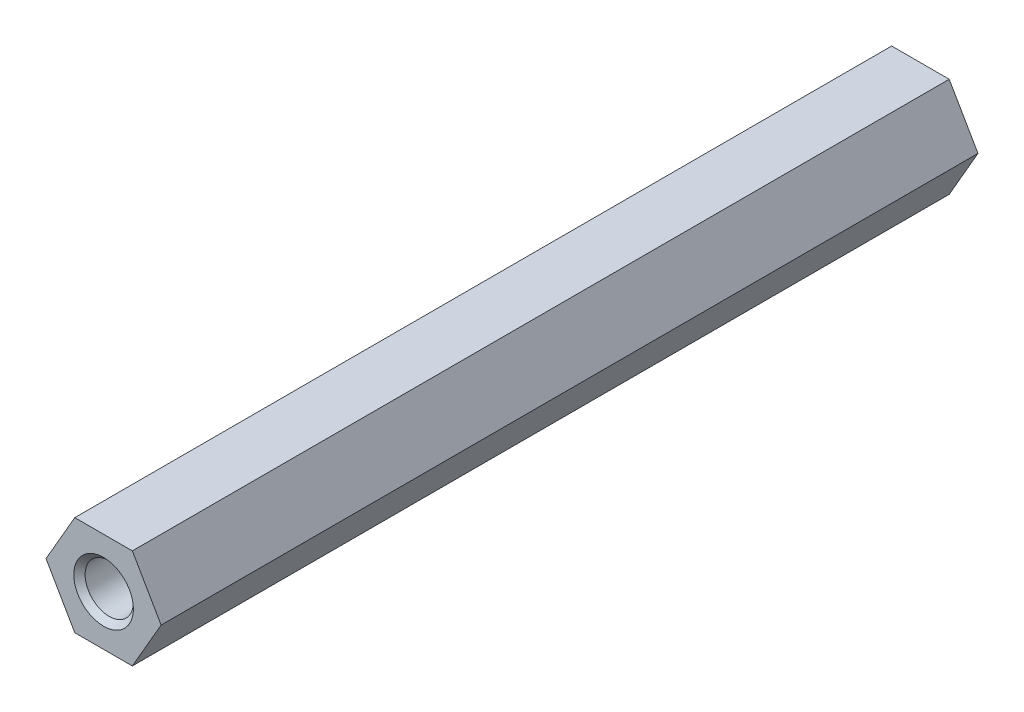
ISO-10303-21;
HEADER;
FILE_DESCRIPTION(('STEP AP214'),'2;1');
FILE_NAME('part.step','',(''),(''),'','','');
FILE_SCHEMA(('AUTOMOTIVE_DESIGN { 1 0 10303 214 1 1 1 1 }'));
ENDSEC;
DATA;
#1=APPLICATION_CONTEXT('core data for automotive mechanical design processes');
#2=APPLICATION_PROTOCOL_DEFINITION('international standard','automotive_design',2000,#1);
#3=PRODUCT_CONTEXT('',#1,'mechanical');
#4=PRODUCT('Part','Part','',(#3));
#5=PRODUCT_RELATED_PRODUCT_CATEGORY('part','',(#4));
#6=PRODUCT_DEFINITION_FORMATION('','',#4);
#7=PRODUCT_DEFINITION_CONTEXT('part definition',#1,'design');
#8=PRODUCT_DEFINITION('design','',#6,#7);
#9=PRODUCT_DEFINITION_SHAPE('','',#8);
#10=(LENGTH_UNIT() NAMED_UNIT(*) SI_UNIT(.MILLI.,.METRE.));
#11=(NAMED_UNIT(*) PLANE_ANGLE_UNIT() SI_UNIT($,.RADIAN.));
#12=(NAMED_UNIT(*) SI_UNIT($,.STERADIAN.) SOLID_ANGLE_UNIT());
#13=UNCERTAINTY_MEASURE_WITH_UNIT(LENGTH_MEASURE(1.E-05),#10,'distance_accuracy_value','');
#14=(GEOMETRIC_REPRESENTATION_CONTEXT(3) GLOBAL_UNCERTAINTY_ASSIGNED_CONTEXT((#13)) GLOBAL_UNIT_ASSIGNED_CONTEXT((#10,
#11,#12)) REPRESENTATION_CONTEXT('',''));
#15=CARTESIAN_POINT('',(0.,0.,0.));
#16=DIRECTION('',(0.,0.,1.));
#17=DIRECTION('',(1.,0.,0.));
#18=AXIS2_PLACEMENT_3D('',#15,#16,#17);
#19=CARTESIAN_POINT('',(1.78978583448784,-3.1,-50.8));
#20=DIRECTION('',(0.866025403784439,-0.5,0.));
#21=DIRECTION('',(0.5,0.866025403784439,0.));
#22=AXIS2_PLACEMENT_3D('',#19,#20,#21);
#23=PLANE('',#22);
#24=DIRECTION('',(0.5,0.866025403784439,0.));
#25=VECTOR('',#24,1.);
#26=CARTESIAN_POINT('',(1.78978583448784,-3.1,0.));
#27=LINE('',#26,#25);
#28=CARTESIAN_POINT('',(1.78978583448784,-3.1,0.));
#29=VERTEX_POINT('',#28);
#30=CARTESIAN_POINT('',(3.57957166897568,0.,0.));
#31=VERTEX_POINT('',#30);
#32=EDGE_CURVE('E123',#29,#31,#27,.T.);
#33=ORIENTED_EDGE('',*,*,#32,.F.);
#34=DIRECTION('',(0.,0.,1.));
#35=VECTOR('',#34,1.);
#36=CARTESIAN_POINT('',(1.78978583448784,-3.1,-50.8));
#37=LINE('',#36,#35);
#38=CARTESIAN_POINT('',(1.78978583448784,-3.1,-50.8));
#39=VERTEX_POINT('',#38);
#40=EDGE_CURVE('E52',#39,#29,#37,.T.);
#41=ORIENTED_EDGE('',*,*,#40,.F.);
#42=DIRECTION('',(0.5,0.866025403784439,0.));
#43=VECTOR('',#42,1.);
#44=CARTESIAN_POINT('',(1.78978583448784,-3.1,-50.8));
#45=LINE('',#44,#43);
#46=CARTESIAN_POINT('',(3.57957166897568,0.,-50.8));
#47=VERTEX_POINT('',#46);
#48=EDGE_CURVE('E139',#39,#47,#45,.T.);
#49=ORIENTED_EDGE('',*,*,#48,.T.);
#50=DIRECTION('',(0.,0.,1.));
#51=VECTOR('',#50,1.);
#52=CARTESIAN_POINT('',(3.57957166897568,0.,-50.8));
#53=LINE('',#52,#51);
#54=EDGE_CURVE('E87',#47,#31,#53,.T.);
#55=ORIENTED_EDGE('',*,*,#54,.T.);
#56=EDGE_LOOP('',(#33,#41,#49,#55));
#57=FACE_BOUND('',#56,.T.);
#58=ADVANCED_FACE('F30',(#57),#23,.T.);
#59=CARTESIAN_POINT('',(-1.78978583448784,-3.1,-50.8));
#60=DIRECTION('',(0.,-1.,0.));
#61=DIRECTION('',(0.,0.,-1.));
#62=AXIS2_PLACEMENT_3D('',#59,#60,#61);
#63=PLANE('',#62);
#64=DIRECTION('',(1.,0.,0.));
#65=VECTOR('',#64,1.);
#66=CARTESIAN_POINT('',(-1.78978583448784,-3.1,0.));
#67=LINE('',#66,#65);
#68=CARTESIAN_POINT('',(-1.78978583448784,-3.1,0.));
#69=VERTEX_POINT('',#68);
#70=EDGE_CURVE('E136',#69,#29,#67,.T.);
#71=ORIENTED_EDGE('',*,*,#70,.F.);
#72=DIRECTION('',(0.,0.,1.));
#73=VECTOR('',#72,1.);
#74=CARTESIAN_POINT('',(-1.78978583448784,-3.1,-50.8));
#75=LINE('',#74,#73);
#76=CARTESIAN_POINT('',(-1.78978583448784,-3.1,-50.8));
#77=VERTEX_POINT('',#76);
#78=EDGE_CURVE('E75',#77,#69,#75,.T.);
#79=ORIENTED_EDGE('',*,*,#78,.F.);
#80=DIRECTION('',(1.,0.,0.));
#81=VECTOR('',#80,1.);
#82=CARTESIAN_POINT('',(-1.78978583448784,-3.1,-50.8));
#83=LINE('',#82,#81);
#84=EDGE_CURVE('E113',#77,#39,#83,.T.);
#85=ORIENTED_EDGE('',*,*,#84,.T.);
#86=ORIENTED_EDGE('',*,*,#40,.T.);
#87=EDGE_LOOP('',(#71,#79,#85,#86));
#88=FACE_BOUND('',#87,.T.);
#89=ADVANCED_FACE('F166',(#88),#63,.T.);
#90=CARTESIAN_POINT('',(-3.57957166897568,0.,-50.8));
#91=DIRECTION('',(-0.866025403784438,-0.5,0.));
#92=DIRECTION('',(0.5,-0.866025403784439,0.));
#93=AXIS2_PLACEMENT_3D('',#90,#91,#92);
#94=PLANE('',#93);
#95=DIRECTION('',(0.5,-0.866025403784438,0.));
#96=VECTOR('',#95,1.);
#97=CARTESIAN_POINT('',(-3.57957166897568,0.,0.));
#98=LINE('',#97,#96);
#99=CARTESIAN_POINT('',(-3.57957166897568,0.,0.));
#100=VERTEX_POINT('',#99);
#101=EDGE_CURVE('E100',#100,#69,#98,.T.);
#102=ORIENTED_EDGE('',*,*,#101,.F.);
#103=DIRECTION('',(0.,0.,1.));
#104=VECTOR('',#103,1.);
#105=CARTESIAN_POINT('',(-3.57957166897568,0.,-50.8));
#106=LINE('',#105,#104);
#107=CARTESIAN_POINT('',(-3.57957166897568,0.,-50.8));
#108=VERTEX_POINT('',#107);
#109=EDGE_CURVE('E95',#108,#100,#106,.T.);
#110=ORIENTED_EDGE('',*,*,#109,.F.);
#111=DIRECTION('',(0.5,-0.866025403784438,0.));
#112=VECTOR('',#111,1.);
#113=CARTESIAN_POINT('',(-3.57957166897568,0.,-50.8));
#114=LINE('',#113,#112);
#115=EDGE_CURVE('E98',#108,#77,#114,.T.);
#116=ORIENTED_EDGE('',*,*,#115,.T.);
#117=ORIENTED_EDGE('',*,*,#78,.T.);
#118=EDGE_LOOP('',(#102,#110,#116,#117));
#119=FACE_BOUND('',#118,.T.);
#120=ADVANCED_FACE('F97',(#119),#94,.T.);
#121=CARTESIAN_POINT('',(-1.78978583448784,3.1,-50.8));
#122=DIRECTION('',(-0.866025403784439,0.5,0.));
#123=DIRECTION('',(-0.5,-0.866025403784439,0.));
#124=AXIS2_PLACEMENT_3D('',#121,#122,#123);
#125=PLANE('',#124);
#126=DIRECTION('',(-0.5,-0.866025403784439,0.));
#127=VECTOR('',#126,1.);
#128=CARTESIAN_POINT('',(-1.78978583448784,3.1,0.));
#129=LINE('',#128,#127);
#130=CARTESIAN_POINT('',(-1.78978583448784,3.1,0.));
#131=VERTEX_POINT('',#130);
#132=EDGE_CURVE('E133',#131,#100,#129,.T.);
#133=ORIENTED_EDGE('',*,*,#132,.F.);
#134=DIRECTION('',(0.,0.,1.));
#135=VECTOR('',#134,1.);
#136=CARTESIAN_POINT('',(-1.78978583448784,3.1,-50.8));
#137=LINE('',#136,#135);
#138=CARTESIAN_POINT('',(-1.78978583448784,3.1,-50.8));
#139=VERTEX_POINT('',#138);
#140=EDGE_CURVE('E105',#139,#131,#137,.T.);
#141=ORIENTED_EDGE('',*,*,#140,.F.);
#142=DIRECTION('',(-0.5,-0.866025403784439,0.));
#143=VECTOR('',#142,1.);
#144=CARTESIAN_POINT('',(-1.78978583448784,3.1,-50.8));
#145=LINE('',#144,#143);
#146=EDGE_CURVE('E111',#139,#108,#145,.T.);
#147=ORIENTED_EDGE('',*,*,#146,.T.);
#148=ORIENTED_EDGE('',*,*,#109,.T.);
#149=EDGE_LOOP('',(#133,#141,#147,#148));
#150=FACE_BOUND('',#149,.T.);
#151=ADVANCED_FACE('F115',(#150),#125,.T.);
#152=CARTESIAN_POINT('',(1.78978583448784,3.1,-50.8));
#153=DIRECTION('',(0.,1.,0.));
#154=DIRECTION('',(-1.,0.,0.));
#155=AXIS2_PLACEMENT_3D('',#152,#153,#154);
#156=PLANE('',#155);
#157=DIRECTION('',(-1.,0.,0.));
#158=VECTOR('',#157,1.);
#159=CARTESIAN_POINT('',(1.78978583448784,3.1,0.));
#160=LINE('',#159,#158);
#161=CARTESIAN_POINT('',(1.78978583448784,3.1,0.));
#162=VERTEX_POINT('',#161);
#163=EDGE_CURVE('E130',#162,#131,#160,.T.);
#164=ORIENTED_EDGE('',*,*,#163,.F.);
#165=DIRECTION('',(0.,0.,1.));
#166=VECTOR('',#165,1.);
#167=CARTESIAN_POINT('',(1.78978583448784,3.1,-50.8));
#168=LINE('',#167,#166);
#169=CARTESIAN_POINT('',(1.78978583448784,3.1,-50.8));
#170=VERTEX_POINT('',#169);
#171=EDGE_CURVE('E143',#170,#162,#168,.T.);
#172=ORIENTED_EDGE('',*,*,#171,.F.);
#173=DIRECTION('',(-1.,0.,0.));
#174=VECTOR('',#173,1.);
#175=CARTESIAN_POINT('',(1.78978583448784,3.1,-50.8));
#176=LINE('',#175,#174);
#177=EDGE_CURVE('E116',#170,#139,#176,.T.);
#178=ORIENTED_EDGE('',*,*,#177,.T.);
#179=ORIENTED_EDGE('',*,*,#140,.T.);
#180=EDGE_LOOP('',(#164,#172,#178,#179));
#181=FACE_BOUND('',#180,.T.);
#182=ADVANCED_FACE('F175',(#181),#156,.T.);
#183=CARTESIAN_POINT('',(3.57957166897568,0.,-50.8));
#184=DIRECTION('',(0.866025403784439,0.5,0.));
#185=DIRECTION('',(-0.5,0.866025403784439,0.));
#186=AXIS2_PLACEMENT_3D('',#183,#184,#185);
#187=PLANE('',#186);
#188=DIRECTION('',(-0.5,0.866025403784439,0.));
#189=VECTOR('',#188,1.);
#190=CARTESIAN_POINT('',(3.57957166897568,0.,0.));
#191=LINE('',#190,#189);
#192=EDGE_CURVE('E126',#31,#162,#191,.T.);
#193=ORIENTED_EDGE('',*,*,#192,.F.);
#194=ORIENTED_EDGE('',*,*,#54,.F.);
#195=DIRECTION('',(-0.5,0.866025403784439,0.));
#196=VECTOR('',#195,1.);
#197=CARTESIAN_POINT('',(3.57957166897568,0.,-50.8));
#198=LINE('',#197,#196);
#199=EDGE_CURVE('E118',#47,#170,#198,.T.);
#200=ORIENTED_EDGE('',*,*,#199,.T.);
#201=ORIENTED_EDGE('',*,*,#171,.T.);
#202=EDGE_LOOP('',(#193,#194,#200,#201));
#203=FACE_BOUND('',#202,.T.);
#204=ADVANCED_FACE('F172',(#203),#187,.T.);
#205=CARTESIAN_POINT('',(0.,-6.2,-50.8));
#206=DIRECTION('',(0.,0.,-1.));
#207=DIRECTION('',(-1.,0.,0.));
#208=AXIS2_PLACEMENT_3D('',#205,#206,#207);
#209=PLANE('',#208);
#210=CARTESIAN_POINT('',(0.000428254180053758,0.000741757998406947,-50.8));
#211=DIRECTION('',(0.,0.,-1.));
#212=DIRECTION('',(-1.,0.,0.));
#213=AXIS2_PLACEMENT_3D('',#210,#211,#212);
#214=CIRCLE('',#213,1.85254999999999);
#215=CARTESIAN_POINT('',(-1.85212174581994,0.000741757998406947,-50.8));
#216=VERTEX_POINT('',#215);
#217=EDGE_CURVE('E11',#216,#216,#214,.F.);
#218=ORIENTED_EDGE('',*,*,#217,.T.);
#219=EDGE_LOOP('',(#218));
#220=FACE_BOUND('',#219,.T.);
#221=ORIENTED_EDGE('',*,*,#48,.F.);
#222=ORIENTED_EDGE('',*,*,#84,.F.);
#223=ORIENTED_EDGE('',*,*,#115,.F.);
#224=ORIENTED_EDGE('',*,*,#146,.F.);
#225=ORIENTED_EDGE('',*,*,#177,.F.);
#226=ORIENTED_EDGE('',*,*,#199,.F.);
#227=EDGE_LOOP('',(#221,#222,#223,#224,#225,#226));
#228=FACE_BOUND('',#227,.T.);
#229=ADVANCED_FACE('F109',(#220,#228),#209,.T.);
#230=CARTESIAN_POINT('',(0.,-6.2,0.));
#231=DIRECTION('',(0.,0.,-1.));
#232=DIRECTION('',(-1.,0.,0.));
#233=AXIS2_PLACEMENT_3D('',#230,#231,#232);
#234=PLANE('',#233);
#235=CARTESIAN_POINT('',(0.000428254180053758,0.000741757998406947,0.));
#236=DIRECTION('',(0.,0.,-1.));
#237=DIRECTION('',(-1.,0.,0.));
#238=AXIS2_PLACEMENT_3D('',#235,#236,#237);
#239=CIRCLE('',#238,1.85254999999998);
#240=CARTESIAN_POINT('',(-1.85212174581993,0.000741757998406947,0.));
#241=VERTEX_POINT('',#240);
#242=EDGE_CURVE('E44',#241,#241,#239,.T.);
#243=ORIENTED_EDGE('',*,*,#242,.T.);
#244=EDGE_LOOP('',(#243));
#245=FACE_BOUND('',#244,.T.);
#246=ORIENTED_EDGE('',*,*,#32,.T.);
#247=ORIENTED_EDGE('',*,*,#192,.T.);
#248=ORIENTED_EDGE('',*,*,#163,.T.);
#249=ORIENTED_EDGE('',*,*,#132,.T.);
#250=ORIENTED_EDGE('',*,*,#101,.T.);
#251=ORIENTED_EDGE('',*,*,#70,.T.);
#252=EDGE_LOOP('',(#246,#247,#248,#249,#250,#251));
#253=FACE_BOUND('',#252,.T.);
#254=ADVANCED_FACE('F149',(#245,#253),#234,.F.);
#255=CARTESIAN_POINT('',(0.000428254180053758,0.000741757998406947,-0.499999999999989));
#256=DIRECTION('',(0.,0.,1.));
#257=DIRECTION('',(1.,0.,0.));
#258=AXIS2_PLACEMENT_3D('',#255,#256,#257);
#259=CONICAL_SURFACE('',#258,1.35254999999999,0.78539816339745);
#260=CARTESIAN_POINT('',(-1.13887388692376,-0.976199913219537,-0.351742085431551));
#261=CARTESIAN_POINT('',(-1.09050740140774,-1.03262422726677,-0.351727999669262));
#262=CARTESIAN_POINT('',(-1.03792822463204,-1.0854607292848,-0.351716889317182));
#263=CARTESIAN_POINT('',(-0.925496150422692,-1.18279074114641,-0.351700867690997));
#264=CARTESIAN_POINT('',(-0.865637840334296,-1.22727797931283,-0.351695961061167));
#265=CARTESIAN_POINT('',(-0.73156878000186,-1.31221566223573,-0.351692238157879));
#266=CARTESIAN_POINT('',(-0.656508760453995,-1.35133460901226,-0.351694322265547));
#267=CARTESIAN_POINT('',(-0.500879254625431,-1.41641772536883,-0.351706564036563));
#268=CARTESIAN_POINT('',(-0.420308546692796,-1.44237896724928,-0.351716723495455));
#269=CARTESIAN_POINT('',(-0.255956494491913,-1.48040491021355,-0.351744827086582));
#270=CARTESIAN_POINT('',(-0.172175426279043,-1.49247080338486,-0.351762770550843));
#271=CARTESIAN_POINT('',(-0.00378173055184395,-1.50236459758979,-0.351805932855938));
#272=CARTESIAN_POINT('',(0.0808308545064723,-1.50019322182451,-0.351831151327166));
#273=CARTESIAN_POINT('',(0.248492519458984,-1.48167634530228,-0.351888149663282));
#274=CARTESIAN_POINT('',(0.331541567071425,-1.4653305522188,-0.351919929663481));
#275=CARTESIAN_POINT('',(0.493717441644787,-1.41892802990144,-0.351989150145478));
#276=CARTESIAN_POINT('',(0.572844230465483,-1.38887116736948,-0.352026590682304));
#277=CARTESIAN_POINT('',(0.724928268785867,-1.31589990246012,-0.352106070152555));
#278=CARTESIAN_POINT('',(0.797885543430412,-1.27298555248874,-0.352148109067237));
#279=CARTESIAN_POINT('',(0.935559768895114,-1.17551753086171,-0.352235593011925));
#280=CARTESIAN_POINT('',(1.00027673016371,-1.12096387396452,-0.352281038037613));
#281=CARTESIAN_POINT('',(1.11963336895297,-1.00176577713641,-0.352374044992566));
#282=CARTESIAN_POINT('',(1.17427303828985,-0.937121329010814,-0.352421606923549));
#283=CARTESIAN_POINT('',(1.27192396520623,-0.799576750704476,-0.352517497920261));
#284=CARTESIAN_POINT('',(1.31493522343341,-0.726676620983566,-0.352565826985947));
#285=CARTESIAN_POINT('',(1.38810837158268,-0.574690092684228,-0.352661880360964));
#286=CARTESIAN_POINT('',(1.41827026084106,-0.495603693786263,-0.352709604670262));
#287=CARTESIAN_POINT('',(1.4648884629052,-0.33348965058808,-0.352803093415658));
#288=CARTESIAN_POINT('',(1.48134477407432,-0.250462005817219,-0.352848857851521));
#289=CARTESIAN_POINT('',(1.5000846663324,-0.0828223950719922,-0.352937127006785));
#290=CARTESIAN_POINT('',(1.50236824815492,0.00178957082037227,-0.352979631726354));
#291=CARTESIAN_POINT('',(1.4926978587608,0.170195937885083,-0.35306017387933));
#292=CARTESIAN_POINT('',(1.48074388833707,0.253990339102961,-0.353098211312986));
#293=CARTESIAN_POINT('',(1.44293773457422,0.418382896422403,-0.353168737978714));
#294=CARTESIAN_POINT('',(1.41708555253506,0.498981052822924,-0.353201227211305));
#295=CARTESIAN_POINT('',(1.35221684240028,0.654693184301824,-0.353259734033128));
#296=CARTESIAN_POINT('',(1.313200314128,0.729807159306607,-0.353285751622272));
#297=CARTESIAN_POINT('',(1.22311048353422,0.872418648019586,-0.35333057552054));
#298=CARTESIAN_POINT('',(1.17203718330923,0.939916163052179,-0.353349381830918));
#299=CARTESIAN_POINT('',(1.05928362468927,1.06537869102613,-0.353379248477601));
#300=CARTESIAN_POINT('',(0.997603366125521,1.1233437038158,-0.353390308813784));
#301=CARTESIAN_POINT('',(0.865386819602973,1.22809576337856,-0.353404369015283));
#302=CARTESIAN_POINT('',(0.794850532546577,1.27488281129065,-0.353407368881421));
#303=CARTESIAN_POINT('',(0.646924248104241,1.35595079840026,-0.353405222841876));
#304=CARTESIAN_POINT('',(0.569534251266561,1.39023173859822,-0.353400076936844));
#305=CARTESIAN_POINT('',(0.410097428054318,1.44531437685661,-0.353381785684094));
#306=CARTESIAN_POINT('',(0.328050602318355,1.46611607676549,-0.353368640337471));
#307=CARTESIAN_POINT('',(0.161629157938013,1.49364974714614,-0.353334723972634));
#308=CARTESIAN_POINT('',(0.0772545387011656,1.50038171403687,-0.353313952952478));
#309=CARTESIAN_POINT('',(-0.0914273470598226,1.49958480769353,-0.353265375777363));
#310=CARTESIAN_POINT('',(-0.17573461356643,1.49205593074815,-0.353237569620573));
#311=CARTESIAN_POINT('',(-0.341888480051729,1.46295106297507,-0.353175712639659));
#312=CARTESIAN_POINT('',(-0.423735081661357,1.44137508145805,-0.353141661819673));
#313=CARTESIAN_POINT('',(-0.582644287786972,1.38478849568124,-0.353068283283234));
#314=CARTESIAN_POINT('',(-0.659706892753876,1.34977789268774,-0.353028955567277));
#315=CARTESIAN_POINT('',(-0.806860619524566,1.26731586412141,-0.352946140700033));
#316=CARTESIAN_POINT('',(-0.876951733477018,1.21986442453787,-0.352902653544061));
#317=CARTESIAN_POINT('',(-1.00817262927218,1.11386780881056,-0.352812755280825));
#318=CARTESIAN_POINT('',(-1.06930242064125,1.05532264446015,-0.352766344176668));
#319=CARTESIAN_POINT('',(-1.180865535778,0.928800377911195,-0.352671916014574));
#320=CARTESIAN_POINT('',(-1.23129884546019,0.860823263292521,-0.352623898954523));
#321=CARTESIAN_POINT('',(-1.32003779399831,0.717366000439248,-0.352527621702651));
#322=CARTESIAN_POINT('',(-1.35834328824553,0.641885762753588,-0.352479361507938));
#323=CARTESIAN_POINT('',(-1.4217375009889,0.485567475894627,-0.352383969582149));
#324=CARTESIAN_POINT('',(-1.44682654912892,0.404729560408849,-0.352336837822957));
#325=CARTESIAN_POINT('',(-1.48307624940783,0.239994869964762,-0.352245042102271));
#326=CARTESIAN_POINT('',(-1.49423782338471,0.156098297832554,-0.352200377977635));
#327=CARTESIAN_POINT('',(-1.50231831113283,-0.0123925825913282,-0.352114773731298));
#328=CARTESIAN_POINT('',(-1.49923498333521,-0.0969869986044824,-0.352073834196729));
#329=CARTESIAN_POINT('',(-1.47890928799384,-0.264477662528767,-0.351996838626896));
#330=CARTESIAN_POINT('',(-1.46166264942481,-0.347373390461412,-0.351960784068545));
#331=CARTESIAN_POINT('',(-1.41349697599861,-0.509047733443741,-0.351894614134923));
#332=CARTESIAN_POINT('',(-1.38258835064896,-0.587829432102291,-0.351864494263037));
#333=CARTESIAN_POINT('',(-1.31760764215494,-0.71961259030189,-0.351817901062881));
#334=CARTESIAN_POINT('',(-1.28638459338841,-0.774040329884582,-0.351799909436793));
#335=CARTESIAN_POINT('',(-1.21739475908469,-0.878560334351302,-0.351767936918241));
#336=CARTESIAN_POINT('',(-1.17962995642849,-0.928653906092273,-0.351753954813847));
#337=CARTESIAN_POINT('',(-1.13887388692376,-0.976199913219537,-0.351742085431551));
#338=B_SPLINE_CURVE_WITH_KNOTS('',3,(#260,#261,#262,#263,#264,#265,#266,#267,#268,#269,#270,
#271,#272,#273,#274,#275,#276,#277,#278,#279,#280,#281,#282,#283,#284,#285,#286,#287,#288,#289,
#290,#291,#292,#293,#294,#295,#296,#297,#298,#299,#300,#301,#302,#303,#304,#305,#306,#307,#308,
#309,#310,#311,#312,#313,#314,#315,#316,#317,#318,#319,#320,#321,#322,#323,#324,#325,#326,#327,
#328,#329,#330,#331,#332,#333,#334,#335,#336,#337),.UNSPECIFIED.,.T.,.F.,(4,2,2,2,2,2,2,2,2,2,2,
2,2,2,2,2,2,2,2,2,2,2,2,2,2,2,2,2,2,2,2,2,2,2,2,2,2,2,4),(0.,0.2227734525108,0.445713580742492,
0.698412340925673,0.951167304041935,1.20390058159383,1.45662102132064,1.70934667315921,
1.96207478203179,2.21480186082031,2.46752861915628,2.72025558273124,2.97298253222971,
3.22570949478218,3.47843648751402,3.7311634671652,3.98389043274164,4.23661737467948,
4.48934432000877,4.7420712213923,4.99479812679726,5.2475250064501,5.50025186588612,
5.75297869066524,6.00570557976867,6.25843253464302,6.51115932200541,6.76388608554687,
7.01661313370747,7.26933991320403,7.52206702549771,7.77479715112597,8.0275209728751,
8.28022806633774,8.53297492698536,8.7857980328562,9.03842883583405,9.22620593624596,
9.4139262185338),.UNSPECIFIED.);
#339=CARTESIAN_POINT('',(-1.13887388692376,-0.976199913219537,-0.351742085431551));
#340=VERTEX_POINT('',#339);
#341=EDGE_CURVE('E127',#340,#340,#338,.T.);
#342=ORIENTED_EDGE('',*,*,#341,.F.);
#343=EDGE_LOOP('',(#342));
#344=FACE_BOUND('',#343,.T.);
#345=ORIENTED_EDGE('',*,*,#242,.F.);
#346=EDGE_LOOP('',(#345));
#347=FACE_BOUND('',#346,.T.);
#348=ADVANCED_FACE('F152',(#344,#347),#259,.F.);
#349=CARTESIAN_POINT('',(0.000428254180053758,0.000741757998406947,-50.8));
#350=DIRECTION('',(0.,0.,-1.));
#351=DIRECTION('',(-1.,0.,0.));
#352=AXIS2_PLACEMENT_3D('',#349,#350,#351);
#353=CONICAL_SURFACE('',#352,1.85254999999999,0.785398163397453);
#354=CARTESIAN_POINT('',(-1.13887388692376,-0.976199913219536,-50.4482579145684));
#355=CARTESIAN_POINT('',(-1.18723843178747,-0.919773935983853,-50.4482438274122));
#356=CARTESIAN_POINT('',(-1.23141316110035,-0.859733459049708,-50.448226758183));
#357=CARTESIAN_POINT('',(-1.31040546193357,-0.733740135733206,-50.4481870264537));
#358=CARTESIAN_POINT('',(-1.34521600783267,-0.667782899409288,-50.4481643597784));
#359=CARTESIAN_POINT('',(-1.40865302819891,-0.522302087482466,-50.448110554884));
#360=CARTESIAN_POINT('',(-1.43583379444896,-0.442142842046596,-50.4480786897268));
#361=CARTESIAN_POINT('',(-1.47635276464908,-0.278391297970539,-50.4480093094729));
#362=CARTESIAN_POINT('',(-1.48968788851056,-0.194798239745311,-50.4479717931212));
#363=CARTESIAN_POINT('',(-1.50213407068702,-0.0265642790959227,-50.4478921795286));
#364=CARTESIAN_POINT('',(-1.50124634707775,0.0580765329759352,-50.4478500826802));
#365=CARTESIAN_POINT('',(-1.48527319944985,0.22600267812474,-50.4477625027296));
#366=CARTESIAN_POINT('',(-1.47018849661105,0.309288079835367,-50.4477170197994));
#367=CARTESIAN_POINT('',(-1.42625075541226,0.472146280386605,-50.4476239548819));
#368=CARTESIAN_POINT('',(-1.39739743222079,0.551719002385616,-50.4475763728514));
#369=CARTESIAN_POINT('',(-1.32674088286473,0.704891693209697,-50.447480460511));
#370=CARTESIAN_POINT('',(-1.28493753080432,0.77849160396033,-50.447432130194));
#371=CARTESIAN_POINT('',(-1.18956794341912,0.917628279196066,-50.4473360938651));
#372=CARTESIAN_POINT('',(-1.13600175683665,0.983165077090997,-50.4472883878506));
#373=CARTESIAN_POINT('',(-1.01862705104427,1.10431538994328,-50.4471949545936));
#374=CARTESIAN_POINT('',(-0.954818544829903,1.15992891749118,-50.4471492273486));
#375=CARTESIAN_POINT('',(-0.8187704436408,1.25965412509601,-50.4470610503185));
#376=CARTESIAN_POINT('',(-0.746530843252084,1.30376579776703,-50.4470186005355));
#377=CARTESIAN_POINT('',(-0.595671260022293,1.37923504344898,-50.4469381844782));
#378=CARTESIAN_POINT('',(-0.51705127754362,1.41059261718434,-50.4469002182037));
#379=CARTESIAN_POINT('',(-0.355662728884892,1.45966351476338,-50.4468298480618));
#380=CARTESIAN_POINT('',(-0.272894163310763,1.47737684059989,-50.4467974441937));
#381=CARTESIAN_POINT('',(-0.105557984089297,1.49865642066053,-50.4467391198771));
#382=CARTESIAN_POINT('',(-0.0209903702287551,1.50222267320809,-50.4467131994293));
#383=CARTESIAN_POINT('',(0.147543252721495,1.49510686622076,-50.4466685788351));
#384=CARTESIAN_POINT('',(0.231509261925835,1.48442480940085,-50.4466498786872));
#385=CARTESIAN_POINT('',(0.396456138406238,1.44911562086183,-50.4466202303695));
#386=CARTESIAN_POINT('',(0.477437005849469,1.42448848992365,-50.4466092821994));
#387=CARTESIAN_POINT('',(0.634114785396172,1.36198824878755,-50.4465954491429));
#388=CARTESIAN_POINT('',(0.709811698093772,1.324115140079,-50.4465925642555));
#389=CARTESIAN_POINT('',(0.853772766143871,1.23619804841858,-50.446594939796));
#390=CARTESIAN_POINT('',(0.922036921393488,1.18615406529824,-50.4466002002239));
#391=CARTESIAN_POINT('',(1.0491946504793,1.07531583059955,-50.4466187168112));
#392=CARTESIAN_POINT('',(1.10808822491993,1.01452157971464,-50.4466319729702));
#393=CARTESIAN_POINT('',(1.21483298378867,0.883908576528084,-50.4466661040945));
#394=CARTESIAN_POINT('',(1.26268416803037,0.814089824074102,-50.44668697906));
#395=CARTESIAN_POINT('',(1.34598579543125,0.667409761390972,-50.4467357543027));
#396=CARTESIAN_POINT('',(1.38143623750136,0.590548450543332,-50.4467636545806));
#397=CARTESIAN_POINT('',(1.43893003975361,0.431965149426326,-50.4468256873272));
#398=CARTESIAN_POINT('',(1.46097340099363,0.350243159540493,-50.4468598197955));
#399=CARTESIAN_POINT('',(1.49102730195576,0.184258336983456,-50.4469333468284));
#400=CARTESIAN_POINT('',(1.49903784098119,0.0999955041861098,-50.4469727413932));
#401=CARTESIAN_POINT('',(1.50079870117062,-0.0686790489165797,-50.4470556732211));
#402=CARTESIAN_POINT('',(1.49454901869464,-0.153090769259921,-50.4470992104851));
#403=CARTESIAN_POINT('',(1.46796683448621,-0.319666906142763,-50.4471891909034));
#404=CARTESIAN_POINT('',(1.44763432765443,-0.40183132186851,-50.4472356340587));
#405=CARTESIAN_POINT('',(1.39346368833675,-0.561580357285832,-50.4473301072025));
#406=CARTESIAN_POINT('',(1.35962556480191,-0.639164980012696,-50.4473781371899));
#407=CARTESIAN_POINT('',(1.27940426137804,-0.787552082523755,-50.4474744203315));
#408=CARTESIAN_POINT('',(1.23302108301913,-0.858354563135167,-50.4475226734858));
#409=CARTESIAN_POINT('',(1.12902628898124,-0.991167594727821,-50.4476180333909));
#410=CARTESIAN_POINT('',(1.07141466066419,-1.05317813581324,-50.4476651401404));
#411=CARTESIAN_POINT('',(0.946598504097642,-1.16664682729712,-50.4477568704136));
#412=CARTESIAN_POINT('',(0.879393987437105,-1.21810499044349,-50.4478014939403));
#413=CARTESIAN_POINT('',(0.737299636982405,-1.30900832810028,-50.4478869919887));
#414=CARTESIAN_POINT('',(0.662409793076331,-1.3484534868044,-50.4479278665055));
#415=CARTESIAN_POINT('',(0.507069880533101,-1.4142114029381,-50.4480047076774));
#416=CARTESIAN_POINT('',(0.426619746714534,-1.4405240063894,-50.4480406742748));
#417=CARTESIAN_POINT('',(0.262445777921176,-1.47926857233383,-50.4481066783533));
#418=CARTESIAN_POINT('',(0.17872202465609,-1.49170088105118,-50.4481367159821));
#419=CARTESIAN_POINT('',(0.0103815654966603,-1.50233315886645,-50.4481900100269));
#420=CARTESIAN_POINT('',(-0.0742350807752674,-1.50053407232657,-50.4482132668926));
#421=CARTESIAN_POINT('',(-0.241979929143891,-1.48275405780929,-50.4482523458092));
#422=CARTESIAN_POINT('',(-0.325107894917352,-1.46677089816226,-50.4482681666894));
#423=CARTESIAN_POINT('',(-0.48752043938656,-1.42107175551264,-50.4482919243096));
#424=CARTESIAN_POINT('',(-0.566803851328524,-1.39135163205025,-50.4482998586703));
#425=CARTESIAN_POINT('',(-0.719211216577299,-1.31902938512337,-50.4483076032475));
#426=CARTESIAN_POINT('',(-0.792339809034895,-1.27643707718621,-50.448307419639));
#427=CARTESIAN_POINT('',(-0.91263621174511,-1.19206850516623,-50.4483000481002));
#428=CARTESIAN_POINT('',(-0.961649198575795,-1.15288966093712,-50.4482946703736));
#429=CARTESIAN_POINT('',(-1.05439002988194,-1.06872817987687,-50.4482795382214));
#430=CARTESIAN_POINT('',(-1.09811946906173,-1.02374730275907,-50.4482697851206));
#431=CARTESIAN_POINT('',(-1.13887388692376,-0.976199913219536,-50.4482579145684));
#432=B_SPLINE_CURVE_WITH_KNOTS('',3,(#354,#355,#356,#357,#358,#359,#360,#361,#362,#363,#364,
#365,#366,#367,#368,#369,#370,#371,#372,#373,#374,#375,#376,#377,#378,#379,#380,#381,#382,#383,
#384,#385,#386,#387,#388,#389,#390,#391,#392,#393,#394,#395,#396,#397,#398,#399,#400,#401,#402,
#403,#404,#405,#406,#407,#408,#409,#410,#411,#412,#413,#414,#415,#416,#417,#418,#419,#420,#421,
#422,#423,#424,#425,#426,#427,#428,#429,#430,#431),.UNSPECIFIED.,.T.,.F.,(4,2,2,2,2,2,2,2,2,2,2,
2,2,2,2,2,2,2,2,2,2,2,2,2,2,2,2,2,2,2,2,2,2,2,2,2,2,2,4),(0.,0.222773451981118,
0.445713579906043,0.698412360877965,0.951167344946568,1.20390068264132,1.45662118265081,
1.70934691091662,1.96207509617389,2.21480223420665,2.46752905157951,2.72025603124041,
2.97298299654659,3.22570992494055,3.47843688328525,3.73116379347354,3.983890689509,
4.23661755712774,4.48934442824465,4.7420712830595,4.99479814214059,5.24752502341672,
5.50025188475143,5.75297875863304,6.00570569702408,6.25843272692679,6.51115958933104,
6.76388642091012,7.01661353694507,7.26934034766829,7.5220674909192,7.77479759730816,
8.02752139956291,8.28022843179587,8.53297523106944,8.78579826051144,9.03842898718984,
9.22620601176886,9.41392621830014),.UNSPECIFIED.);
#433=CARTESIAN_POINT('',(-1.13887388692376,-0.976199913219536,-50.4482579145684));
#434=VERTEX_POINT('',#433);
#435=EDGE_CURVE('E35',#434,#434,#432,.T.);
#436=ORIENTED_EDGE('',*,*,#435,.F.);
#437=EDGE_LOOP('',(#436));
#438=FACE_BOUND('',#437,.T.);
#439=ORIENTED_EDGE('',*,*,#217,.F.);
#440=EDGE_LOOP('',(#439));
#441=FACE_BOUND('',#440,.T.);
#442=ADVANCED_FACE('F32',(#438,#441),#353,.F.);
#443=CARTESIAN_POINT('',(0.,0.,-50.8));
#444=DIRECTION('',(0.,0.,1.));
#445=DIRECTION('',(1.,0.,0.));
#446=AXIS2_PLACEMENT_3D('',#443,#444,#445);
#447=CYLINDRICAL_SURFACE('',#446,1.5);
#448=ORIENTED_EDGE('',*,*,#341,.T.);
#449=EDGE_LOOP('',(#448));
#450=FACE_BOUND('',#449,.T.);
#451=ORIENTED_EDGE('',*,*,#435,.T.);
#452=EDGE_LOOP('',(#451));
#453=FACE_BOUND('',#452,.T.);
#454=ADVANCED_FACE('F159',(#450,#453),#447,.F.);
#455=CLOSED_SHELL('',(#58,#89,#120,#151,#182,#204,#229,#254,#348,#442,#454));
#456=MANIFOLD_SOLID_BREP('B2',#455);
#457=ADVANCED_BREP_SHAPE_REPRESENTATION('',(#18,#456),#14);
#458=SHAPE_DEFINITION_REPRESENTATION(#9,#457);
ENDSEC;
END-ISO-10303-21;
